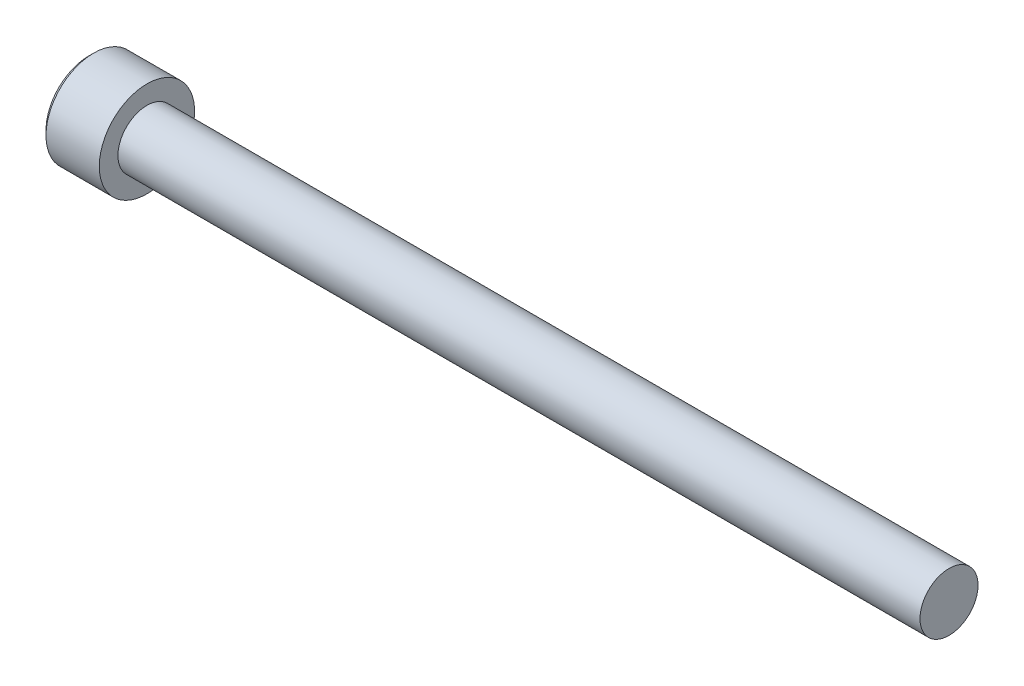
ISO-10303-21;
HEADER;
FILE_DESCRIPTION(('STEP AP214'),'2;1');
FILE_NAME('part.step','',(''),(''),'','','');
FILE_SCHEMA(('AUTOMOTIVE_DESIGN { 1 0 10303 214 1 1 1 1 }'));
ENDSEC;
DATA;
#1=APPLICATION_CONTEXT('core data for automotive mechanical design processes');
#2=APPLICATION_PROTOCOL_DEFINITION('international standard','automotive_design',2000,#1);
#3=PRODUCT_CONTEXT('',#1,'mechanical');
#4=PRODUCT('Part','Part','',(#3));
#5=PRODUCT_RELATED_PRODUCT_CATEGORY('part','',(#4));
#6=PRODUCT_DEFINITION_FORMATION('','',#4);
#7=PRODUCT_DEFINITION_CONTEXT('part definition',#1,'design');
#8=PRODUCT_DEFINITION('design','',#6,#7);
#9=PRODUCT_DEFINITION_SHAPE('','',#8);
#10=(LENGTH_UNIT() NAMED_UNIT(*) SI_UNIT(.MILLI.,.METRE.));
#11=(NAMED_UNIT(*) PLANE_ANGLE_UNIT() SI_UNIT($,.RADIAN.));
#12=(NAMED_UNIT(*) SI_UNIT($,.STERADIAN.) SOLID_ANGLE_UNIT());
#13=UNCERTAINTY_MEASURE_WITH_UNIT(LENGTH_MEASURE(1.E-05),#10,'distance_accuracy_value','');
#14=(GEOMETRIC_REPRESENTATION_CONTEXT(3) GLOBAL_UNCERTAINTY_ASSIGNED_CONTEXT((#13)) GLOBAL_UNIT_ASSIGNED_CONTEXT((#10,
#11,#12)) REPRESENTATION_CONTEXT('',''));
#15=CARTESIAN_POINT('',(0.,0.,0.));
#16=DIRECTION('',(0.,0.,1.));
#17=DIRECTION('',(1.,0.,0.));
#18=AXIS2_PLACEMENT_3D('',#15,#16,#17);
#19=CARTESIAN_POINT('',(-2.28600000000007,-1.14567944042317,1.984375));
#20=DIRECTION('',(0.,0.,1.));
#21=DIRECTION('',(1.,0.,0.));
#22=AXIS2_PLACEMENT_3D('',#19,#20,#21);
#23=PLANE('',#22);
#24=CARTESIAN_POINT('',(-4.82599999995852,1.14567944044653,1.98437499999554));
#25=CARTESIAN_POINT('',(-4.78691618362732,1.06743880343266,1.9843749999984));
#26=CARTESIAN_POINT('',(-4.75011447684892,0.987898318960917,1.98437499999957));
#27=CARTESIAN_POINT('',(-4.68265620500518,0.825677042028778,1.98437500000043));
#28=CARTESIAN_POINT('',(-4.65204056061138,0.742979382529199,1.98437500000012));
#29=CARTESIAN_POINT('',(-4.5991739228306,0.575193959555969,1.98437499999988));
#30=CARTESIAN_POINT('',(-4.57689462080725,0.490115359117279,1.98437499999997));
#31=CARTESIAN_POINT('',(-4.54259467221837,0.318093091130193,1.98437500000003));
#32=CARTESIAN_POINT('',(-4.5305423022885,0.231156054976726,1.984375));
#33=CARTESIAN_POINT('',(-4.52249110263747,0.119918521511051,1.984375));
#34=CARTESIAN_POINT('',(-4.52118947557477,0.0959468443046798,1.984375));
#35=CARTESIAN_POINT('',(-4.51945182629813,0.0479845644411998,1.984375));
#36=CARTESIAN_POINT('',(-4.51901533386223,0.0239939791589393,1.984375));
#37=CARTESIAN_POINT('',(-4.51901809008399,-0.0602201717457363,1.984375));
#38=CARTESIAN_POINT('',(-4.52177452299902,-0.120461721905447,1.984375));
#39=CARTESIAN_POINT('',(-4.5326365512493,-0.240474970989197,1.984375));
#40=CARTESIAN_POINT('',(-4.54074587749718,-0.300246312758427,1.984375));
#41=CARTESIAN_POINT('',(-4.57259622946939,-0.478763752804282,1.984375));
#42=CARTESIAN_POINT('',(-4.60385422611702,-0.596208828937734,1.984375));
#43=CARTESIAN_POINT('',(-4.66780003592237,-0.785921487441256,1.984375));
#44=CARTESIAN_POINT('',(-4.69623457768558,-0.859734609866899,1.984375));
#45=CARTESIAN_POINT('',(-4.75786140400812,-1.00456595519282,1.984375));
#46=CARTESIAN_POINT('',(-4.79100779300359,-1.07560356657101,1.984375));
#47=CARTESIAN_POINT('',(-4.82599999995643,-1.14567944044724,1.984375));
#48=B_SPLINE_CURVE_WITH_KNOTS('',3,(#24,#25,#26,#27,#28,#29,#30,#31,#32,#33,#34,#35,#36,#37,#38,
#39,#40,#41,#42,#43,#44,#45,#46,#47),.UNSPECIFIED.,.F.,.F.,(4,2,2,2,2,2,2,2,2,2,2,4),(0.,
0.262559005207405,0.526801735838036,0.790138824405318,1.05265603861765,1.12466619182083,
1.19663719499031,1.3772702672652,1.55802937209382,1.92104085090328,2.15819130092264,
2.39317265078575),.UNSPECIFIED.);
#49=CARTESIAN_POINT('',(-4.82599999996829,1.14567944041753,1.98437500003084));
#50=VERTEX_POINT('',#49);
#51=CARTESIAN_POINT('',(-4.8259999999622,-1.14567944043207,1.98437500001542));
#52=VERTEX_POINT('',#51);
#53=EDGE_CURVE('E21',#50,#52,#48,.T.);
#54=ORIENTED_EDGE('',*,*,#53,.F.);
#55=DIRECTION('',(1.,0.,0.));
#56=VECTOR('',#55,1.);
#57=CARTESIAN_POINT('',(-2.28600000000007,1.14567944042316,1.984375));
#58=LINE('',#57,#56);
#59=CARTESIAN_POINT('',(-2.28600000000007,1.14567944042316,1.984375));
#60=VERTEX_POINT('',#59);
#61=EDGE_CURVE('E69',#50,#60,#58,.T.);
#62=ORIENTED_EDGE('',*,*,#61,.T.);
#63=DIRECTION('',(0.,1.,0.));
#64=VECTOR('',#63,1.);
#65=CARTESIAN_POINT('',(-2.28600000000007,0.,1.984375));
#66=LINE('',#65,#64);
#67=CARTESIAN_POINT('',(-2.28600000000007,-1.14567944042317,1.984375));
#68=VERTEX_POINT('',#67);
#69=EDGE_CURVE('E75',#68,#60,#66,.T.);
#70=ORIENTED_EDGE('',*,*,#69,.F.);
#71=DIRECTION('',(1.,0.,0.));
#72=VECTOR('',#71,1.);
#73=CARTESIAN_POINT('',(-2.28600000000007,-1.14567944042317,1.984375));
#74=LINE('',#73,#72);
#75=EDGE_CURVE('E72',#68,#52,#74,.F.);
#76=ORIENTED_EDGE('',*,*,#75,.T.);
#77=EDGE_LOOP('',(#54,#62,#70,#76));
#78=FACE_BOUND('',#77,.T.);
#79=ADVANCED_FACE('F17',(#78),#23,.F.);
#80=CARTESIAN_POINT('',(-2.28600000000007,0.,0.));
#81=DIRECTION('',(-1.,0.,0.));
#82=DIRECTION('',(0.,0.,1.));
#83=AXIS2_PLACEMENT_3D('',#80,#81,#82);
#84=PLANE('',#83);
#85=DIRECTION('',(0.,0.5,0.866025403784439));
#86=VECTOR('',#85,1.);
#87=CARTESIAN_POINT('',(-2.28600000000007,2.29135888084633,0.));
#88=LINE('',#87,#86);
#89=CARTESIAN_POINT('',(-2.28600000000007,2.29135888084633,0.));
#90=VERTEX_POINT('',#89);
#91=CARTESIAN_POINT('',(-2.28600000000007,1.14567944042316,-1.984375));
#92=VERTEX_POINT('',#91);
#93=EDGE_CURVE('E83',#90,#92,#88,.F.);
#94=ORIENTED_EDGE('',*,*,#93,.T.);
#95=DIRECTION('',(0.,1.,0.));
#96=VECTOR('',#95,1.);
#97=CARTESIAN_POINT('',(-2.28600000000007,1.14567944042316,-1.984375));
#98=LINE('',#97,#96);
#99=CARTESIAN_POINT('',(-2.28600000000007,-1.14567944042316,-1.984375));
#100=VERTEX_POINT('',#99);
#101=EDGE_CURVE('E243',#92,#100,#98,.F.);
#102=ORIENTED_EDGE('',*,*,#101,.T.);
#103=DIRECTION('',(0.,0.5,-0.866025403784439));
#104=VECTOR('',#103,1.);
#105=CARTESIAN_POINT('',(-2.28600000000007,-1.14567944042316,-1.984375));
#106=LINE('',#105,#104);
#107=CARTESIAN_POINT('',(-2.28600000000007,-2.29135888084633,0.));
#108=VERTEX_POINT('',#107);
#109=EDGE_CURVE('E228',#100,#108,#106,.F.);
#110=ORIENTED_EDGE('',*,*,#109,.T.);
#111=DIRECTION('',(0.,-0.5,-0.866025403784439));
#112=VECTOR('',#111,1.);
#113=CARTESIAN_POINT('',(-2.28600000000007,-2.29135888084633,0.));
#114=LINE('',#113,#112);
#115=EDGE_CURVE('E225',#108,#68,#114,.F.);
#116=ORIENTED_EDGE('',*,*,#115,.T.);
#117=ORIENTED_EDGE('',*,*,#69,.T.);
#118=DIRECTION('',(0.,-0.5,0.866025403784439));
#119=VECTOR('',#118,1.);
#120=CARTESIAN_POINT('',(-2.28600000000007,1.14567944042316,1.984375));
#121=LINE('',#120,#119);
#122=EDGE_CURVE('E82',#60,#90,#121,.F.);
#123=ORIENTED_EDGE('',*,*,#122,.T.);
#124=EDGE_LOOP('',(#94,#102,#110,#116,#117,#123));
#125=FACE_BOUND('',#124,.T.);
#126=ADVANCED_FACE('F161',(#125),#84,.T.);
#127=CARTESIAN_POINT('',(-2.28600000000007,-1.14567944042316,-1.984375));
#128=DIRECTION('',(0.,-0.866025403784439,-0.5));
#129=DIRECTION('',(0.,0.5,-0.866025403784439));
#130=AXIS2_PLACEMENT_3D('',#127,#128,#129);
#131=PLANE('',#130);
#132=CARTESIAN_POINT('',(-4.82599999995871,-1.14567944040756,-1.98437500001887));
#133=CARTESIAN_POINT('',(-4.78666022792997,-1.18505700230148,-1.91617106214563));
#134=CARTESIAN_POINT('',(-4.74963132844072,-1.22509295783734,-1.8468267530301));
#135=CARTESIAN_POINT('',(-4.68183299424977,-1.30673037975396,-1.70542659047317));
#136=CARTESIAN_POINT('',(-4.65110127019237,-1.34833960561553,-1.63335729721673));
#137=CARTESIAN_POINT('',(-4.59845762010516,-1.432242568594,-1.48803310243203));
#138=CARTESIAN_POINT('',(-4.57641341195893,-1.47451494967301,-1.41481519064643));
#139=CARTESIAN_POINT('',(-4.54245011067441,-1.55999007976842,-1.26676792253773));
#140=CARTESIAN_POINT('',(-4.53050567471972,-1.6031902195197,-1.19194308559438));
#141=CARTESIAN_POINT('',(-4.51972842752365,-1.67764765054852,-1.06297903205139));
#142=CARTESIAN_POINT('',(-4.51813352794834,-1.70880881707173,-1.00900630841009));
#143=CARTESIAN_POINT('',(-4.52082392138599,-1.77108016542046,-0.901149169214274));
#144=CARTESIAN_POINT('',(-4.52511127545884,-1.80219032554946,-0.847264791239237));
#145=CARTESIAN_POINT('',(-4.53932219421538,-1.86411684097343,-0.740004920189235));
#146=CARTESIAN_POINT('',(-4.54925206045723,-1.8949328285454,-0.686630064029166));
#147=CARTESIAN_POINT('',(-4.5742029484467,-1.95603190279815,-0.580803363127978));
#148=CARTESIAN_POINT('',(-4.58922357974385,-1.98631503016081,-0.528351447923769));
#149=CARTESIAN_POINT('',(-4.63380478900425,-2.06386502548479,-0.394030915895904));
#150=CARTESIAN_POINT('',(-4.66672213384104,-2.11065153226583,-0.312994309042484));
#151=CARTESIAN_POINT('',(-4.72228952038986,-2.17944749410732,-0.193836207777459));
#152=CARTESIAN_POINT('',(-4.74181309375939,-2.20211890802843,-0.154568166986659));
#153=CARTESIAN_POINT('',(-4.78263970065987,-2.24704195201531,-0.0767591723707469));
#154=CARTESIAN_POINT('',(-4.80394164363173,-2.2692938292399,-0.0382177904539708));
#155=CARTESIAN_POINT('',(-4.82599999995675,-2.29135888085868,2.13931096265935E-11));
#156=B_SPLINE_CURVE_WITH_KNOTS('',3,(#132,#133,#134,#135,#136,#137,#138,#139,#140,#141,#142,
#143,#144,#145,#146,#147,#148,#149,#150,#151,#152,#153,#154,#155),.UNSPECIFIED.,.F.,.F.,(4,2,2,
2,2,2,2,2,2,2,2,4),(0.,0.264284909626495,0.530108996358094,0.791712695414128,1.05265800174404,
1.23942150116703,1.42625045663858,1.61328847394198,1.80031214908683,2.09727151182814,
2.24534838946042,2.39333511890876),.UNSPECIFIED.);
#157=CARTESIAN_POINT('',(-4.8259999999622,-1.14567944043207,-1.98437500001542));
#158=VERTEX_POINT('',#157);
#159=CARTESIAN_POINT('',(-4.82599999996846,-2.2913588808704,-2.00043543490866E-11));
#160=VERTEX_POINT('',#159);
#161=EDGE_CURVE('E163',#158,#160,#156,.T.);
#162=ORIENTED_EDGE('',*,*,#161,.T.);
#163=DIRECTION('',(1.,0.,0.));
#164=VECTOR('',#163,1.);
#165=CARTESIAN_POINT('',(-2.28600000000007,-2.29135888084633,0.));
#166=LINE('',#165,#164);
#167=EDGE_CURVE('E236',#160,#108,#166,.T.);
#168=ORIENTED_EDGE('',*,*,#167,.T.);
#169=ORIENTED_EDGE('',*,*,#109,.F.);
#170=DIRECTION('',(-1.,0.,0.));
#171=VECTOR('',#170,1.);
#172=CARTESIAN_POINT('',(-2.28600000000007,-1.14567944042316,-1.984375));
#173=LINE('',#172,#171);
#174=EDGE_CURVE('E246',#100,#158,#173,.T.);
#175=ORIENTED_EDGE('',*,*,#174,.T.);
#176=EDGE_LOOP('',(#162,#168,#169,#175));
#177=FACE_BOUND('',#176,.T.);
#178=ADVANCED_FACE('F157',(#177),#131,.F.);
#179=CARTESIAN_POINT('',(-2.28600000000007,-2.29135888084633,0.));
#180=DIRECTION('',(0.,-0.866025403784439,0.5));
#181=DIRECTION('',(0.,-0.5,-0.866025403784439));
#182=AXIS2_PLACEMENT_3D('',#179,#180,#181);
#183=PLANE('',#182);
#184=CARTESIAN_POINT('',(-4.8259999999587,-2.29135888085486,-2.29477011545215E-11));
#185=CARTESIAN_POINT('',(-4.78666022792997,-2.25198131896546,0.0682039378529047));
#186=CARTESIAN_POINT('',(-4.74963132844072,-2.21194536343147,0.137548246969502));
#187=CARTESIAN_POINT('',(-4.68183299424977,-2.13030794151622,0.278948409527228));
#188=CARTESIAN_POINT('',(-4.65110127019237,-2.08869871565414,0.351017702783377));
#189=CARTESIAN_POINT('',(-4.59845762010516,-2.00479575267531,0.496341897567867));
#190=CARTESIAN_POINT('',(-4.57641341195893,-1.96252337159644,0.569559809353539));
#191=CARTESIAN_POINT('',(-4.5424501106744,-1.87704824150112,0.717607077462299));
#192=CARTESIAN_POINT('',(-4.53050567471972,-1.8338481017498,0.792431914405622));
#193=CARTESIAN_POINT('',(-4.51972842752365,-1.75939067072096,0.921395967948603));
#194=CARTESIAN_POINT('',(-4.51813352794834,-1.72822950419776,0.975368691589913));
#195=CARTESIAN_POINT('',(-4.52082392138599,-1.66595815584903,1.08322583078573));
#196=CARTESIAN_POINT('',(-4.52511127545884,-1.63484799572003,1.13711020876076));
#197=CARTESIAN_POINT('',(-4.53932219421538,-1.57292148029607,1.24437007981077));
#198=CARTESIAN_POINT('',(-4.54925206045723,-1.54210549272409,1.29774493597084));
#199=CARTESIAN_POINT('',(-4.5742029484467,-1.48100641847134,1.40357163687202));
#200=CARTESIAN_POINT('',(-4.58922357974385,-1.45072329110868,1.45602355207623));
#201=CARTESIAN_POINT('',(-4.63380478900421,-1.37317329578476,1.59034408410398));
#202=CARTESIAN_POINT('',(-4.66672213384095,-1.32638678900379,1.6713806909573));
#203=CARTESIAN_POINT('',(-4.72228952038968,-1.25759082716239,1.79053879222216));
#204=CARTESIAN_POINT('',(-4.74181309375917,-1.23491941324131,1.82980683301291));
#205=CARTESIAN_POINT('',(-4.78263970065959,-1.18999636925449,1.90761582762873));
#206=CARTESIAN_POINT('',(-4.8039416436314,-1.16774449202993,1.94615720954545));
#207=CARTESIAN_POINT('',(-4.82599999995639,-1.14567944041117,1.98437500002077));
#208=B_SPLINE_CURVE_WITH_KNOTS('',3,(#184,#185,#186,#187,#188,#189,#190,#191,#192,#193,#194,
#195,#196,#197,#198,#199,#200,#201,#202,#203,#204,#205,#206,#207),.UNSPECIFIED.,.F.,.F.,(4,2,2,
2,2,2,2,2,2,2,2,4),(0.,0.264284909626493,0.530108996358089,0.791712695414125,1.05265800174404,
1.23942150116703,1.42625045663858,1.61328847394198,1.80031214908683,2.09727151182773,
2.24534838945981,2.39333511890795),.UNSPECIFIED.);
#209=EDGE_CURVE('E92',#160,#52,#208,.T.);
#210=ORIENTED_EDGE('',*,*,#209,.T.);
#211=ORIENTED_EDGE('',*,*,#75,.F.);
#212=ORIENTED_EDGE('',*,*,#115,.F.);
#213=ORIENTED_EDGE('',*,*,#167,.F.);
#214=EDGE_LOOP('',(#210,#211,#212,#213));
#215=FACE_BOUND('',#214,.T.);
#216=ADVANCED_FACE('F152',(#215),#183,.F.);
#217=CARTESIAN_POINT('',(-2.28600000000007,1.14567944042316,1.984375));
#218=DIRECTION('',(0.,0.866025403784439,0.5));
#219=DIRECTION('',(0.,-0.5,0.866025403784439));
#220=AXIS2_PLACEMENT_3D('',#217,#218,#219);
#221=PLANE('',#220);
#222=CARTESIAN_POINT('',(-4.82599999995852,1.14567944040762,1.98437500001801));
#223=CARTESIAN_POINT('',(-4.78666022792973,1.1850570023017,1.91617106214498));
#224=CARTESIAN_POINT('',(-4.74963132844047,1.22509295783761,1.84682675302957));
#225=CARTESIAN_POINT('',(-4.68183299424957,1.30673037975422,1.70542659047278));
#226=CARTESIAN_POINT('',(-4.65110127019222,1.34833960561574,1.63335729721638));
#227=CARTESIAN_POINT('',(-4.59845762010509,1.43224256859413,1.48803310243178));
#228=CARTESIAN_POINT('',(-4.57641341195888,1.47451494967311,1.41481519064625));
#229=CARTESIAN_POINT('',(-4.54245011067439,1.55999007976846,1.26676792253767));
#230=CARTESIAN_POINT('',(-4.53050567471972,1.6031902195197,1.19194308559439));
#231=CARTESIAN_POINT('',(-4.51972842752365,1.67764765054848,1.06297903205146));
#232=CARTESIAN_POINT('',(-4.51813352794835,1.70880881707169,1.00900630841016));
#233=CARTESIAN_POINT('',(-4.52082392138598,1.77108016542041,0.901149169214364));
#234=CARTESIAN_POINT('',(-4.52511127545883,1.80219032554941,0.847264791239333));
#235=CARTESIAN_POINT('',(-4.53932219421536,1.86411684097336,0.740004920189342));
#236=CARTESIAN_POINT('',(-4.54925206045721,1.89493282854533,0.686630064029278));
#237=CARTESIAN_POINT('',(-4.57420294844667,1.95603190279808,0.5808033631281));
#238=CARTESIAN_POINT('',(-4.58922357974382,1.98631503016074,0.528351447923897));
#239=CARTESIAN_POINT('',(-4.6338047890042,2.06386502548473,0.394030915896012));
#240=CARTESIAN_POINT('',(-4.666722133841,2.11065153226578,0.312994309042568));
#241=CARTESIAN_POINT('',(-4.72228952038984,2.17944749410729,0.19383620777751));
#242=CARTESIAN_POINT('',(-4.74181309375937,2.20211890802841,0.1545681669867));
#243=CARTESIAN_POINT('',(-4.78263970065986,2.24704195201529,0.0767591723707674));
#244=CARTESIAN_POINT('',(-4.80394164363172,2.26929382923989,0.0382177904539813));
#245=CARTESIAN_POINT('',(-4.82599999995675,2.29135888085868,-2.1392886942985E-11));
#246=B_SPLINE_CURVE_WITH_KNOTS('',3,(#222,#223,#224,#225,#226,#227,#228,#229,#230,#231,#232,
#233,#234,#235,#236,#237,#238,#239,#240,#241,#242,#243,#244,#245),.UNSPECIFIED.,.F.,.F.,(4,2,2,
2,2,2,2,2,2,2,2,4),(0.,0.26428490962629,0.530108996357672,0.791712695413487,1.05265800174319,
1.23942150116616,1.42625045663768,1.61328847394106,1.80031214908589,2.09727151182728,
2.2453483894596,2.39333511890798),.UNSPECIFIED.);
#247=CARTESIAN_POINT('',(-4.82599999996846,2.29135888087039,2.00042061038936E-11));
#248=VERTEX_POINT('',#247);
#249=EDGE_CURVE('E80',#50,#248,#246,.T.);
#250=ORIENTED_EDGE('',*,*,#249,.T.);
#251=DIRECTION('',(1.,0.,0.));
#252=VECTOR('',#251,1.);
#253=CARTESIAN_POINT('',(-2.28600000000007,2.29135888084633,0.));
#254=LINE('',#253,#252);
#255=EDGE_CURVE('E247',#248,#90,#254,.T.);
#256=ORIENTED_EDGE('',*,*,#255,.T.);
#257=ORIENTED_EDGE('',*,*,#122,.F.);
#258=ORIENTED_EDGE('',*,*,#61,.F.);
#259=EDGE_LOOP('',(#250,#256,#257,#258));
#260=FACE_BOUND('',#259,.T.);
#261=ADVANCED_FACE('F77',(#260),#221,.F.);
#262=CARTESIAN_POINT('',(-2.28600000000007,2.29135888084633,0.));
#263=DIRECTION('',(0.,0.866025403784439,-0.5));
#264=DIRECTION('',(0.,0.5,0.866025403784439));
#265=AXIS2_PLACEMENT_3D('',#262,#263,#264);
#266=PLANE('',#265);
#267=CARTESIAN_POINT('',(-4.82599999995871,2.29135888085486,2.29489280696874E-11));
#268=CARTESIAN_POINT('',(-4.78666022792997,2.25198131896547,-0.0682039378529039));
#269=CARTESIAN_POINT('',(-4.74963132844072,2.21194536343147,-0.137548246969502));
#270=CARTESIAN_POINT('',(-4.68183299424977,2.13030794151622,-0.278948409527229));
#271=CARTESIAN_POINT('',(-4.65110127019237,2.08869871565414,-0.351017702783379));
#272=CARTESIAN_POINT('',(-4.59845762010516,2.00479575267531,-0.496341897567869));
#273=CARTESIAN_POINT('',(-4.57641341195893,1.96252337159644,-0.569559809353541));
#274=CARTESIAN_POINT('',(-4.5424501106744,1.87704824150112,-0.7176070774623));
#275=CARTESIAN_POINT('',(-4.53050567471972,1.8338481017498,-0.792431914405622));
#276=CARTESIAN_POINT('',(-4.51972842752365,1.75939067072096,-0.921395967948603));
#277=CARTESIAN_POINT('',(-4.51813352794834,1.72822950419776,-0.975368691589912));
#278=CARTESIAN_POINT('',(-4.52082392138599,1.66595815584903,-1.08322583078573));
#279=CARTESIAN_POINT('',(-4.52511127545884,1.63484799572003,-1.13711020876076));
#280=CARTESIAN_POINT('',(-4.53932219421538,1.57292148029607,-1.24437007981077));
#281=CARTESIAN_POINT('',(-4.54925206045723,1.54210549272409,-1.29774493597083));
#282=CARTESIAN_POINT('',(-4.5742029484467,1.48100641847134,-1.40357163687202));
#283=CARTESIAN_POINT('',(-4.58922357974385,1.45072329110868,-1.45602355207623));
#284=CARTESIAN_POINT('',(-4.63380478900425,1.3731732957847,-1.5903440841041));
#285=CARTESIAN_POINT('',(-4.66672213384104,1.32638678900366,-1.67138069095752));
#286=CARTESIAN_POINT('',(-4.72228952038986,1.25759082716218,-1.79053879222254));
#287=CARTESIAN_POINT('',(-4.74181309375939,1.23491941324106,-1.82980683301334));
#288=CARTESIAN_POINT('',(-4.78263970065987,1.18999636925419,-1.90761582762925));
#289=CARTESIAN_POINT('',(-4.80394164363173,1.1677444920296,-1.94615720954603));
#290=CARTESIAN_POINT('',(-4.82599999995675,1.14567944041081,-1.98437500002139));
#291=B_SPLINE_CURVE_WITH_KNOTS('',3,(#267,#268,#269,#270,#271,#272,#273,#274,#275,#276,#277,
#278,#279,#280,#281,#282,#283,#284,#285,#286,#287,#288,#289,#290),.UNSPECIFIED.,.F.,.F.,(4,2,2,
2,2,2,2,2,2,2,2,4),(0.,0.264284909626495,0.530108996358093,0.791712695414127,1.05265800174404,
1.23942150116703,1.42625045663858,1.61328847394198,1.80031214908683,2.09727151182814,
2.24534838946042,2.39333511890876),.UNSPECIFIED.);
#292=CARTESIAN_POINT('',(-4.82599999996846,1.14567944045252,-1.98437500001084));
#293=VERTEX_POINT('',#292);
#294=EDGE_CURVE('E40',#248,#293,#291,.T.);
#295=ORIENTED_EDGE('',*,*,#294,.T.);
#296=DIRECTION('',(-1.,0.,0.));
#297=VECTOR('',#296,1.);
#298=CARTESIAN_POINT('',(-2.28600000000007,1.14567944042316,-1.984375));
#299=LINE('',#298,#297);
#300=EDGE_CURVE('E167',#293,#92,#299,.F.);
#301=ORIENTED_EDGE('',*,*,#300,.T.);
#302=ORIENTED_EDGE('',*,*,#93,.F.);
#303=ORIENTED_EDGE('',*,*,#255,.F.);
#304=EDGE_LOOP('',(#295,#301,#302,#303));
#305=FACE_BOUND('',#304,.T.);
#306=ADVANCED_FACE('F151',(#305),#266,.F.);
#307=CARTESIAN_POINT('',(-2.28600000000007,1.14567944042316,-1.984375));
#308=DIRECTION('',(0.,0.,-1.));
#309=DIRECTION('',(-1.,0.,0.));
#310=AXIS2_PLACEMENT_3D('',#307,#308,#309);
#311=PLANE('',#310);
#312=CARTESIAN_POINT('',(-4.8259999999587,1.14567944044731,-1.98437499999592));
#313=CARTESIAN_POINT('',(-4.78666022793094,1.06692431665146,-1.98437499999853));
#314=CARTESIAN_POINT('',(-4.74963132844318,0.986852405569011,-1.98437499999961));
#315=CARTESIAN_POINT('',(-4.6818329942566,0.823577561711963,-1.9843750000004));
#316=CARTESIAN_POINT('',(-4.65110127020207,0.740359109975722,-1.98437500000011));
#317=CARTESIAN_POINT('',(-4.59845762012233,0.572553183993917,-1.9843749999999));
#318=CARTESIAN_POINT('',(-4.57641341198063,0.488008421824127,-1.98437499999997));
#319=CARTESIAN_POINT('',(-4.54245011070673,0.317058161610178,-1.98437500000003));
#320=CARTESIAN_POINT('',(-4.53050567475816,0.230657882096267,-1.98437500000001));
#321=CARTESIAN_POINT('',(-4.51972842757294,0.0817430200124032,-1.984375));
#322=CARTESIAN_POINT('',(-4.51813352800283,0.0194206869508218,-1.984375));
#323=CARTESIAN_POINT('',(-4.52082392145254,-0.1051220097764,-1.984375));
#324=CARTESIAN_POINT('',(-4.52511127553227,-0.167342330049008,-1.984375));
#325=CARTESIAN_POINT('',(-4.53932219430377,-0.291195360925477,-1.984375));
#326=CARTESIAN_POINT('',(-4.54925206055372,-0.352827336083362,-1.984375));
#327=CARTESIAN_POINT('',(-4.57420294856008,-0.475025484616114,-1.984375));
#328=CARTESIAN_POINT('',(-4.58922357986604,-0.535591739354747,-1.984375));
#329=CARTESIAN_POINT('',(-4.63380478912724,-0.690691729958653,-1.984375));
#330=CARTESIAN_POINT('',(-4.66672213394715,-0.784264743465576,-1.984375));
#331=CARTESIAN_POINT('',(-4.7222895204619,-0.921856667069616,-1.984375));
#332=CARTESIAN_POINT('',(-4.74181309381856,-0.967199494886089,-1.984375));
#333=CARTESIAN_POINT('',(-4.78263970069104,-1.05704558280959,-1.984375));
#334=CARTESIAN_POINT('',(-4.80394164364776,-1.10154933723428,-1.984375));
#335=CARTESIAN_POINT('',(-4.82599999995675,-1.14567944044787,-1.984375));
#336=B_SPLINE_CURVE_WITH_KNOTS('',3,(#312,#313,#314,#315,#316,#317,#318,#319,#320,#321,#322,
#323,#324,#325,#326,#327,#328,#329,#330,#331,#332,#333,#334,#335),.UNSPECIFIED.,.F.,.F.,(4,2,2,
2,2,2,2,2,2,2,2,4),(0.,0.264284909658836,0.530108996422784,0.791712695509868,1.0526580018708,
1.23942150133878,1.42625045685537,1.61328847420389,1.80031214939384,2.09727151196384,
2.24534838950992,2.39333511887245),.UNSPECIFIED.);
#337=EDGE_CURVE('E109',#293,#158,#336,.T.);
#338=ORIENTED_EDGE('',*,*,#337,.T.);
#339=ORIENTED_EDGE('',*,*,#174,.F.);
#340=ORIENTED_EDGE('',*,*,#101,.F.);
#341=ORIENTED_EDGE('',*,*,#300,.F.);
#342=EDGE_LOOP('',(#338,#339,#340,#341));
#343=FACE_BOUND('',#342,.T.);
#344=ADVANCED_FACE('F122',(#343),#311,.F.);
#345=CARTESIAN_POINT('',(-4.82599999998001,0.,0.));
#346=DIRECTION('',(-1.,0.,0.));
#347=DIRECTION('',(0.,0.,1.));
#348=AXIS2_PLACEMENT_3D('',#345,#346,#347);
#349=CONICAL_SURFACE('',#348,2.29135888088194,0.785398163397448);
#350=ORIENTED_EDGE('',*,*,#161,.F.);
#351=CARTESIAN_POINT('',(-4.82599999998001,0.,0.));
#352=DIRECTION('',(-1.,0.,0.));
#353=DIRECTION('',(0.,0.,1.));
#354=AXIS2_PLACEMENT_3D('',#351,#352,#353);
#355=CIRCLE('',#354,2.29135888088194);
#356=EDGE_CURVE('E106',#158,#160,#355,.T.);
#357=ORIENTED_EDGE('',*,*,#356,.T.);
#358=EDGE_LOOP('',(#350,#357));
#359=FACE_BOUND('',#358,.T.);
#360=ADVANCED_FACE('F168',(#359),#349,.F.);
#361=CARTESIAN_POINT('',(-4.82599999998001,0.,0.));
#362=DIRECTION('',(-1.,0.,0.));
#363=DIRECTION('',(0.,0.,1.));
#364=AXIS2_PLACEMENT_3D('',#361,#362,#363);
#365=CONICAL_SURFACE('',#364,2.29135888088194,0.785398163397448);
#366=ORIENTED_EDGE('',*,*,#209,.F.);
#367=CARTESIAN_POINT('',(-4.82599999998001,0.,0.));
#368=DIRECTION('',(-1.,0.,0.));
#369=DIRECTION('',(0.,0.,1.));
#370=AXIS2_PLACEMENT_3D('',#367,#368,#369);
#371=CIRCLE('',#370,2.29135888088194);
#372=EDGE_CURVE('E87',#160,#52,#371,.T.);
#373=ORIENTED_EDGE('',*,*,#372,.T.);
#374=EDGE_LOOP('',(#366,#373));
#375=FACE_BOUND('',#374,.T.);
#376=ADVANCED_FACE('F171',(#375),#365,.F.);
#377=CARTESIAN_POINT('',(-4.82599999998001,0.,0.));
#378=DIRECTION('',(-1.,0.,0.));
#379=DIRECTION('',(0.,0.,1.));
#380=AXIS2_PLACEMENT_3D('',#377,#378,#379);
#381=CONICAL_SURFACE('',#380,2.29135888088194,0.78539816348948);
#382=CARTESIAN_POINT('',(-4.82599999998001,0.,0.));
#383=DIRECTION('',(-1.,0.,0.));
#384=DIRECTION('',(0.,0.,1.));
#385=AXIS2_PLACEMENT_3D('',#382,#383,#384);
#386=CIRCLE('',#385,2.29135888088194);
#387=EDGE_CURVE('E60',#52,#50,#386,.T.);
#388=ORIENTED_EDGE('',*,*,#387,.T.);
#389=ORIENTED_EDGE('',*,*,#53,.T.);
#390=EDGE_LOOP('',(#388,#389));
#391=FACE_BOUND('',#390,.T.);
#392=ADVANCED_FACE('F85',(#391),#381,.F.);
#393=CARTESIAN_POINT('',(-4.82599999998001,0.,0.));
#394=DIRECTION('',(-1.,0.,0.));
#395=DIRECTION('',(0.,0.,1.));
#396=AXIS2_PLACEMENT_3D('',#393,#394,#395);
#397=CONICAL_SURFACE('',#396,2.29135888088194,0.785398163397448);
#398=ORIENTED_EDGE('',*,*,#249,.F.);
#399=CARTESIAN_POINT('',(-4.82599999998001,0.,0.));
#400=DIRECTION('',(-1.,0.,0.));
#401=DIRECTION('',(0.,0.,1.));
#402=AXIS2_PLACEMENT_3D('',#399,#400,#401);
#403=CIRCLE('',#402,2.29135888088194);
#404=EDGE_CURVE('E86',#50,#248,#403,.T.);
#405=ORIENTED_EDGE('',*,*,#404,.T.);
#406=EDGE_LOOP('',(#398,#405));
#407=FACE_BOUND('',#406,.T.);
#408=ADVANCED_FACE('F91',(#407),#397,.F.);
#409=CARTESIAN_POINT('',(-4.82599999998001,0.,0.));
#410=DIRECTION('',(-1.,0.,0.));
#411=DIRECTION('',(0.,0.,1.));
#412=AXIS2_PLACEMENT_3D('',#409,#410,#411);
#413=CONICAL_SURFACE('',#412,2.29135888088194,0.785398163397448);
#414=ORIENTED_EDGE('',*,*,#294,.F.);
#415=CARTESIAN_POINT('',(-4.82599999998001,0.,0.));
#416=DIRECTION('',(-1.,0.,0.));
#417=DIRECTION('',(0.,0.,1.));
#418=AXIS2_PLACEMENT_3D('',#415,#416,#417);
#419=CIRCLE('',#418,2.29135888088194);
#420=EDGE_CURVE('E98',#248,#293,#419,.T.);
#421=ORIENTED_EDGE('',*,*,#420,.T.);
#422=EDGE_LOOP('',(#414,#421));
#423=FACE_BOUND('',#422,.T.);
#424=ADVANCED_FACE('F129',(#423),#413,.F.);
#425=CARTESIAN_POINT('',(-4.82599999998001,0.,0.));
#426=DIRECTION('',(-1.,0.,0.));
#427=DIRECTION('',(0.,0.,1.));
#428=AXIS2_PLACEMENT_3D('',#425,#426,#427);
#429=CONICAL_SURFACE('',#428,2.29135888088194,0.785398163489476);
#430=ORIENTED_EDGE('',*,*,#337,.F.);
#431=CARTESIAN_POINT('',(-4.82599999998001,0.,0.));
#432=DIRECTION('',(-1.,0.,0.));
#433=DIRECTION('',(0.,0.,1.));
#434=AXIS2_PLACEMENT_3D('',#431,#432,#433);
#435=CIRCLE('',#434,2.29135888088194);
#436=EDGE_CURVE('E100',#293,#158,#435,.T.);
#437=ORIENTED_EDGE('',*,*,#436,.T.);
#438=EDGE_LOOP('',(#430,#437));
#439=FACE_BOUND('',#438,.T.);
#440=ADVANCED_FACE('F125',(#439),#429,.F.);
#441=CARTESIAN_POINT('',(-4.82600000000007,0.,0.));
#442=DIRECTION('',(1.,0.,0.));
#443=DIRECTION('',(0.,0.,-1.));
#444=AXIS2_PLACEMENT_3D('',#441,#442,#443);
#445=PLANE('',#444);
#446=CARTESIAN_POINT('',(-4.82599999998001,0.,0.));
#447=DIRECTION('',(1.,0.,0.));
#448=DIRECTION('',(0.,0.,-1.));
#449=AXIS2_PLACEMENT_3D('',#446,#447,#448);
#450=CIRCLE('',#449,3.56615999999121);
#451=CARTESIAN_POINT('',(-4.82599999998001,0.,-3.56615999999121));
#452=VERTEX_POINT('',#451);
#453=EDGE_CURVE('E213',#452,#452,#450,.T.);
#454=ORIENTED_EDGE('',*,*,#453,.F.);
#455=EDGE_LOOP('',(#454));
#456=FACE_BOUND('',#455,.T.);
#457=ORIENTED_EDGE('',*,*,#420,.F.);
#458=ORIENTED_EDGE('',*,*,#404,.F.);
#459=ORIENTED_EDGE('',*,*,#387,.F.);
#460=ORIENTED_EDGE('',*,*,#372,.F.);
#461=ORIENTED_EDGE('',*,*,#356,.F.);
#462=ORIENTED_EDGE('',*,*,#436,.F.);
#463=EDGE_LOOP('',(#457,#458,#459,#460,#461,#462));
#464=FACE_BOUND('',#463,.T.);
#465=ADVANCED_FACE('F95',(#456,#464),#445,.F.);
#466=CARTESIAN_POINT('',(-4.42976000010731,0.,0.));
#467=DIRECTION('',(1.,0.,0.));
#468=DIRECTION('',(0.,0.,-1.));
#469=AXIS2_PLACEMENT_3D('',#466,#467,#468);
#470=CONICAL_SURFACE('',#469,3.96239999986392,0.785398163397448);
#471=CARTESIAN_POINT('',(-4.42976000000007,0.,0.));
#472=DIRECTION('',(-1.,0.,0.));
#473=DIRECTION('',(0.,0.,1.));
#474=AXIS2_PLACEMENT_3D('',#471,#472,#473);
#475=CIRCLE('',#474,3.9624);
#476=CARTESIAN_POINT('',(-4.42976000000007,0.,3.9624));
#477=VERTEX_POINT('',#476);
#478=EDGE_CURVE('E210',#477,#477,#475,.F.);
#479=ORIENTED_EDGE('',*,*,#478,.F.);
#480=EDGE_LOOP('',(#479));
#481=FACE_BOUND('',#480,.T.);
#482=ORIENTED_EDGE('',*,*,#453,.T.);
#483=EDGE_LOOP('',(#482));
#484=FACE_BOUND('',#483,.T.);
#485=ADVANCED_FACE('F199',(#481,#484),#470,.T.);
#486=CARTESIAN_POINT('',(-4.82600000000008,0.,0.));
#487=DIRECTION('',(-1.,0.,0.));
#488=DIRECTION('',(0.,0.,1.));
#489=AXIS2_PLACEMENT_3D('',#486,#487,#488);
#490=CYLINDRICAL_SURFACE('',#489,3.9624);
#491=ORIENTED_EDGE('',*,*,#478,.T.);
#492=EDGE_LOOP('',(#491));
#493=FACE_BOUND('',#492,.T.);
#494=CARTESIAN_POINT('',(0.,0.,0.));
#495=DIRECTION('',(-1.,0.,0.));
#496=DIRECTION('',(0.,0.,1.));
#497=AXIS2_PLACEMENT_3D('',#494,#495,#496);
#498=CIRCLE('',#497,3.9624);
#499=CARTESIAN_POINT('',(0.,0.,3.9624));
#500=VERTEX_POINT('',#499);
#501=EDGE_CURVE('E215',#500,#500,#498,.T.);
#502=ORIENTED_EDGE('',*,*,#501,.T.);
#503=EDGE_LOOP('',(#502));
#504=FACE_BOUND('',#503,.T.);
#505=ADVANCED_FACE('F196',(#493,#504),#490,.T.);
#506=CARTESIAN_POINT('',(66.675,0.,0.));
#507=DIRECTION('',(1.,0.,0.));
#508=DIRECTION('',(0.,0.,-1.));
#509=AXIS2_PLACEMENT_3D('',#506,#507,#508);
#510=PLANE('',#509);
#511=CARTESIAN_POINT('',(66.675,0.,0.));
#512=DIRECTION('',(-1.,0.,0.));
#513=DIRECTION('',(0.,0.,1.));
#514=AXIS2_PLACEMENT_3D('',#511,#512,#513);
#515=CIRCLE('',#514,2.413);
#516=CARTESIAN_POINT('',(66.675,0.,2.413));
#517=VERTEX_POINT('',#516);
#518=EDGE_CURVE('E31',#517,#517,#515,.T.);
#519=ORIENTED_EDGE('',*,*,#518,.F.);
#520=EDGE_LOOP('',(#519));
#521=FACE_BOUND('',#520,.T.);
#522=ADVANCED_FACE('F189',(#521),#510,.T.);
#523=CARTESIAN_POINT('',(0.,3.9624,0.));
#524=DIRECTION('',(-1.,0.,0.));
#525=DIRECTION('',(0.,0.,1.));
#526=AXIS2_PLACEMENT_3D('',#523,#524,#525);
#527=PLANE('',#526);
#528=CARTESIAN_POINT('',(0.,0.,0.));
#529=DIRECTION('',(-1.,0.,0.));
#530=DIRECTION('',(0.,0.,1.));
#531=AXIS2_PLACEMENT_3D('',#528,#529,#530);
#532=CIRCLE('',#531,2.413);
#533=CARTESIAN_POINT('',(0.,0.,2.413));
#534=VERTEX_POINT('',#533);
#535=EDGE_CURVE('E11',#534,#534,#532,.F.);
#536=ORIENTED_EDGE('',*,*,#535,.F.);
#537=EDGE_LOOP('',(#536));
#538=FACE_BOUND('',#537,.T.);
#539=ORIENTED_EDGE('',*,*,#501,.F.);
#540=EDGE_LOOP('',(#539));
#541=FACE_BOUND('',#540,.T.);
#542=ADVANCED_FACE('F183',(#538,#541),#527,.F.);
#543=CARTESIAN_POINT('',(66.675,0.,0.));
#544=DIRECTION('',(-1.,0.,0.));
#545=DIRECTION('',(0.,0.,1.));
#546=AXIS2_PLACEMENT_3D('',#543,#544,#545);
#547=CYLINDRICAL_SURFACE('',#546,2.413);
#548=ORIENTED_EDGE('',*,*,#535,.T.);
#549=EDGE_LOOP('',(#548));
#550=FACE_BOUND('',#549,.T.);
#551=ORIENTED_EDGE('',*,*,#518,.T.);
#552=EDGE_LOOP('',(#551));
#553=FACE_BOUND('',#552,.T.);
#554=ADVANCED_FACE('F181',(#550,#553),#547,.T.);
#555=CLOSED_SHELL('',(#79,#126,#178,#216,#261,#306,#344,#360,#376,#392,#408,#424,#440,#465,#485,
#505,#522,#542,#554));
#556=MANIFOLD_SOLID_BREP('B1',#555);
#557=ADVANCED_BREP_SHAPE_REPRESENTATION('',(#18,#556),#14);
#558=SHAPE_DEFINITION_REPRESENTATION(#9,#557);
ENDSEC;
END-ISO-10303-21;
